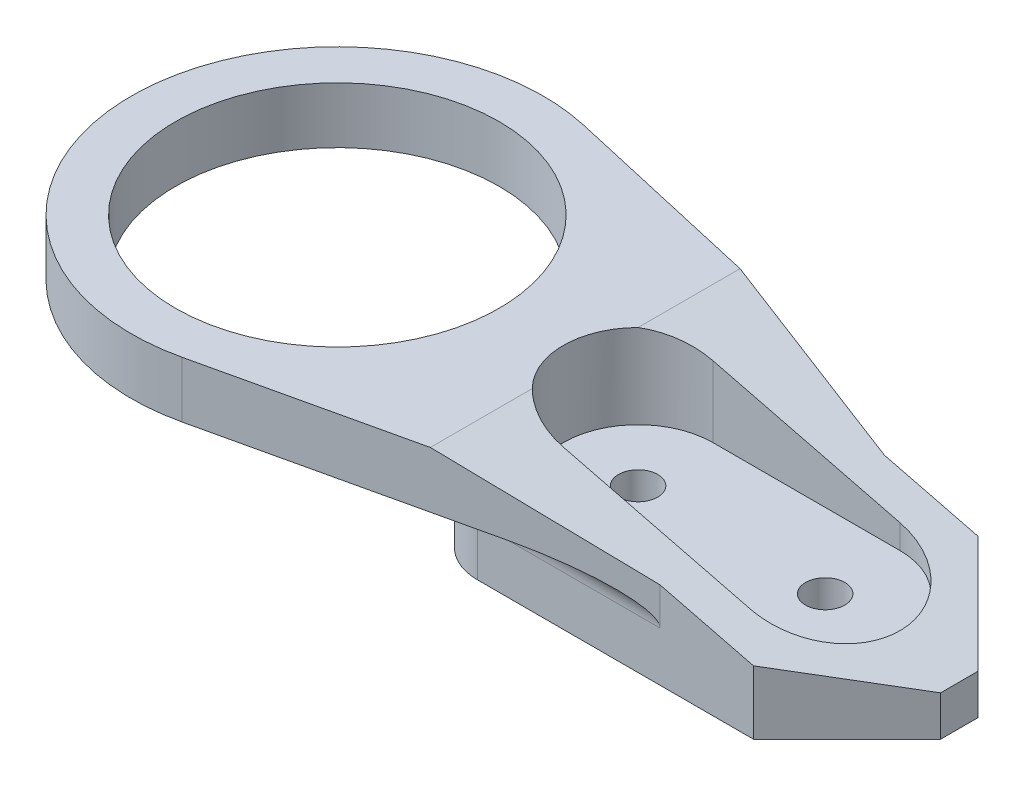
ISO-10303-21;
HEADER;
FILE_DESCRIPTION(('STEP AP214'),'2;1');
FILE_NAME('part.step','',(''),(''),'','','');
FILE_SCHEMA(('AUTOMOTIVE_DESIGN { 1 0 10303 214 1 1 1 1 }'));
ENDSEC;
DATA;
#1=APPLICATION_CONTEXT('core data for automotive mechanical design processes');
#2=APPLICATION_PROTOCOL_DEFINITION('international standard','automotive_design',2000,#1);
#3=PRODUCT_CONTEXT('',#1,'mechanical');
#4=PRODUCT('Part','Part','',(#3));
#5=PRODUCT_RELATED_PRODUCT_CATEGORY('part','',(#4));
#6=PRODUCT_DEFINITION_FORMATION('','',#4);
#7=PRODUCT_DEFINITION_CONTEXT('part definition',#1,'design');
#8=PRODUCT_DEFINITION('design','',#6,#7);
#9=PRODUCT_DEFINITION_SHAPE('','',#8);
#10=(LENGTH_UNIT() NAMED_UNIT(*) SI_UNIT(.MILLI.,.METRE.));
#11=(NAMED_UNIT(*) PLANE_ANGLE_UNIT() SI_UNIT($,.RADIAN.));
#12=(NAMED_UNIT(*) SI_UNIT($,.STERADIAN.) SOLID_ANGLE_UNIT());
#13=UNCERTAINTY_MEASURE_WITH_UNIT(LENGTH_MEASURE(1.E-05),#10,'distance_accuracy_value','');
#14=(GEOMETRIC_REPRESENTATION_CONTEXT(3) GLOBAL_UNCERTAINTY_ASSIGNED_CONTEXT((#13)) GLOBAL_UNIT_ASSIGNED_CONTEXT((#10,
#11,#12)) REPRESENTATION_CONTEXT('',''));
#15=CARTESIAN_POINT('',(0.,0.,0.));
#16=DIRECTION('',(0.,0.,1.));
#17=DIRECTION('',(1.,0.,0.));
#18=AXIS2_PLACEMENT_3D('',#15,#16,#17);
#19=CARTESIAN_POINT('',(17.8298933663439,-2.85,6.));
#20=DIRECTION('',(0.,1.,0.));
#21=DIRECTION('',(0.,0.,1.));
#22=AXIS2_PLACEMENT_3D('',#19,#20,#21);
#23=CYLINDRICAL_SURFACE('',#22,1.05);
#24=CARTESIAN_POINT('',(17.8298933663439,0.,6.));
#25=DIRECTION('',(0.,1.,0.));
#26=DIRECTION('',(-1.,0.,0.));
#27=AXIS2_PLACEMENT_3D('',#24,#25,#26);
#28=CIRCLE('',#27,1.05);
#29=CARTESIAN_POINT('',(16.7798933663439,0.,6.));
#30=VERTEX_POINT('',#29);
#31=EDGE_CURVE('E230',#30,#30,#28,.T.);
#32=ORIENTED_EDGE('',*,*,#31,.F.);
#33=EDGE_LOOP('',(#32));
#34=FACE_BOUND('',#33,.T.);
#35=CARTESIAN_POINT('',(17.8298933663439,2.65,6.));
#36=DIRECTION('',(0.,1.,0.));
#37=DIRECTION('',(0.,0.,1.));
#38=AXIS2_PLACEMENT_3D('',#35,#36,#37);
#39=CIRCLE('',#38,1.05);
#40=CARTESIAN_POINT('',(17.8298933663439,2.65,7.05));
#41=VERTEX_POINT('',#40);
#42=EDGE_CURVE('E227',#41,#41,#39,.F.);
#43=ORIENTED_EDGE('',*,*,#42,.F.);
#44=EDGE_LOOP('',(#43));
#45=FACE_BOUND('',#44,.T.);
#46=ADVANCED_FACE('F42',(#34,#45),#23,.F.);
#47=CARTESIAN_POINT('',(7.82989336634394,-2.85,6.));
#48=DIRECTION('',(0.,1.,0.));
#49=DIRECTION('',(0.,0.,1.));
#50=AXIS2_PLACEMENT_3D('',#47,#48,#49);
#51=CYLINDRICAL_SURFACE('',#50,1.05);
#52=CARTESIAN_POINT('',(7.82989336634394,0.,6.));
#53=DIRECTION('',(0.,1.,0.));
#54=DIRECTION('',(-1.,0.,0.));
#55=AXIS2_PLACEMENT_3D('',#52,#53,#54);
#56=CIRCLE('',#55,1.05);
#57=CARTESIAN_POINT('',(6.77989336634394,0.,6.));
#58=VERTEX_POINT('',#57);
#59=EDGE_CURVE('E233',#58,#58,#56,.T.);
#60=ORIENTED_EDGE('',*,*,#59,.F.);
#61=EDGE_LOOP('',(#60));
#62=FACE_BOUND('',#61,.T.);
#63=CARTESIAN_POINT('',(7.82989336634394,2.65,6.));
#64=DIRECTION('',(0.,1.,0.));
#65=DIRECTION('',(0.,0.,1.));
#66=AXIS2_PLACEMENT_3D('',#63,#64,#65);
#67=CIRCLE('',#66,1.05);
#68=CARTESIAN_POINT('',(7.82989336634394,2.65,7.05));
#69=VERTEX_POINT('',#68);
#70=EDGE_CURVE('E222',#69,#69,#67,.F.);
#71=ORIENTED_EDGE('',*,*,#70,.F.);
#72=EDGE_LOOP('',(#71));
#73=FACE_BOUND('',#72,.T.);
#74=ADVANCED_FACE('F462',(#62,#73),#51,.F.);
#75=CARTESIAN_POINT('',(0.,0.,12.));
#76=DIRECTION('',(0.,0.,-1.));
#77=DIRECTION('',(-1.,0.,0.));
#78=AXIS2_PLACEMENT_3D('',#75,#76,#77);
#79=PLANE('',#78);
#80=DIRECTION('',(0.,1.,0.));
#81=VECTOR('',#80,1.);
#82=CARTESIAN_POINT('',(15.,4.15,12.));
#83=LINE('',#82,#81);
#84=CARTESIAN_POINT('',(15.,2.65,12.));
#85=VERTEX_POINT('',#84);
#86=CARTESIAN_POINT('',(15.,4.64999999999996,12.));
#87=VERTEX_POINT('',#86);
#88=EDGE_CURVE('E262',#85,#87,#83,.T.);
#89=ORIENTED_EDGE('',*,*,#88,.F.);
#90=DIRECTION('',(1.,0.,0.));
#91=VECTOR('',#90,1.);
#92=CARTESIAN_POINT('',(5.25,2.65,12.));
#93=LINE('',#92,#91);
#94=CARTESIAN_POINT('',(5.25,2.65,12.));
#95=VERTEX_POINT('',#94);
#96=EDGE_CURVE('E346',#85,#95,#93,.F.);
#97=ORIENTED_EDGE('',*,*,#96,.T.);
#98=DIRECTION('',(0.,1.,0.));
#99=VECTOR('',#98,1.);
#100=CARTESIAN_POINT('',(5.25,0.,12.));
#101=LINE('',#100,#99);
#102=CARTESIAN_POINT('',(5.25,0.,12.));
#103=VERTEX_POINT('',#102);
#104=EDGE_CURVE('E327',#95,#103,#101,.F.);
#105=ORIENTED_EDGE('',*,*,#104,.T.);
#106=DIRECTION('',(1.,0.,0.));
#107=VECTOR('',#106,1.);
#108=CARTESIAN_POINT('',(25.,0.,12.));
#109=LINE('',#108,#107);
#110=CARTESIAN_POINT('',(20.,0.,12.));
#111=VERTEX_POINT('',#110);
#112=EDGE_CURVE('E270',#103,#111,#109,.T.);
#113=ORIENTED_EDGE('',*,*,#112,.T.);
#114=DIRECTION('',(0.,1.,0.));
#115=VECTOR('',#114,1.);
#116=CARTESIAN_POINT('',(20.,0.,12.));
#117=LINE('',#116,#115);
#118=CARTESIAN_POINT('',(20.,3.39999999999998,12.));
#119=VERTEX_POINT('',#118);
#120=EDGE_CURVE('E292',#111,#119,#117,.T.);
#121=ORIENTED_EDGE('',*,*,#120,.T.);
#122=DIRECTION('',(0.970142500145333,-0.24253562503633,0.));
#123=VECTOR('',#122,1.);
#124=CARTESIAN_POINT('',(4.99999999999971,7.15,12.));
#125=LINE('',#124,#123);
#126=EDGE_CURVE('E288',#119,#87,#125,.F.);
#127=ORIENTED_EDGE('',*,*,#126,.T.);
#128=EDGE_LOOP('',(#89,#97,#105,#113,#121,#127));
#129=FACE_BOUND('',#128,.T.);
#130=ADVANCED_FACE('F443',(#129),#79,.F.);
#131=CARTESIAN_POINT('',(25.,0.,12.));
#132=DIRECTION('',(0.,1.,0.));
#133=DIRECTION('',(-1.,0.,0.));
#134=AXIS2_PLACEMENT_3D('',#131,#132,#133);
#135=PLANE('',#134);
#136=ORIENTED_EDGE('',*,*,#59,.T.);
#137=EDGE_LOOP('',(#136));
#138=FACE_BOUND('',#137,.T.);
#139=ORIENTED_EDGE('',*,*,#31,.T.);
#140=EDGE_LOOP('',(#139));
#141=FACE_BOUND('',#140,.T.);
#142=ORIENTED_EDGE('',*,*,#112,.F.);
#143=CARTESIAN_POINT('',(5.25,0.,9.));
#144=DIRECTION('',(0.,1.,0.));
#145=DIRECTION('',(-1.,0.,0.));
#146=AXIS2_PLACEMENT_3D('',#143,#144,#145);
#147=CIRCLE('',#146,3.);
#148=CARTESIAN_POINT('',(2.25,0.,9.));
#149=VERTEX_POINT('',#148);
#150=EDGE_CURVE('E331',#103,#149,#147,.F.);
#151=ORIENTED_EDGE('',*,*,#150,.T.);
#152=DIRECTION('',(0.,0.,1.));
#153=VECTOR('',#152,1.);
#154=CARTESIAN_POINT('',(2.25,0.,12.));
#155=LINE('',#154,#153);
#156=CARTESIAN_POINT('',(2.25,0.,3.));
#157=VERTEX_POINT('',#156);
#158=EDGE_CURVE('E242',#157,#149,#155,.T.);
#159=ORIENTED_EDGE('',*,*,#158,.F.);
#160=CARTESIAN_POINT('',(5.25,0.,3.));
#161=DIRECTION('',(0.,1.,0.));
#162=DIRECTION('',(-1.,0.,0.));
#163=AXIS2_PLACEMENT_3D('',#160,#161,#162);
#164=CIRCLE('',#163,3.);
#165=CARTESIAN_POINT('',(5.25,0.,0.));
#166=VERTEX_POINT('',#165);
#167=EDGE_CURVE('E329',#157,#166,#164,.F.);
#168=ORIENTED_EDGE('',*,*,#167,.T.);
#169=DIRECTION('',(1.,0.,0.));
#170=VECTOR('',#169,1.);
#171=CARTESIAN_POINT('',(25.,0.,0.));
#172=LINE('',#171,#170);
#173=CARTESIAN_POINT('',(20.,0.,0.));
#174=VERTEX_POINT('',#173);
#175=EDGE_CURVE('E261',#166,#174,#172,.T.);
#176=ORIENTED_EDGE('',*,*,#175,.T.);
#177=DIRECTION('',(0.707106781186549,0.,0.707106781186547));
#178=VECTOR('',#177,1.);
#179=CARTESIAN_POINT('',(25.,0.,5.00000000000001));
#180=LINE('',#179,#178);
#181=CARTESIAN_POINT('',(25.,0.,5.00000000000001));
#182=VERTEX_POINT('',#181);
#183=EDGE_CURVE('E304',#174,#182,#180,.T.);
#184=ORIENTED_EDGE('',*,*,#183,.T.);
#185=DIRECTION('',(0.,0.,-1.));
#186=VECTOR('',#185,1.);
#187=CARTESIAN_POINT('',(25.,0.,12.));
#188=LINE('',#187,#186);
#189=CARTESIAN_POINT('',(25.,0.,6.99999999999997));
#190=VERTEX_POINT('',#189);
#191=EDGE_CURVE('E272',#190,#182,#188,.T.);
#192=ORIENTED_EDGE('',*,*,#191,.F.);
#193=DIRECTION('',(0.707106781186547,0.,-0.707106781186549));
#194=VECTOR('',#193,1.);
#195=CARTESIAN_POINT('',(20.,0.,12.));
#196=LINE('',#195,#194);
#197=EDGE_CURVE('E306',#190,#111,#196,.F.);
#198=ORIENTED_EDGE('',*,*,#197,.T.);
#199=EDGE_LOOP('',(#142,#151,#159,#168,#176,#184,#192,#198));
#200=FACE_BOUND('',#199,.T.);
#201=ADVANCED_FACE('F386',(#138,#141,#200),#135,.F.);
#202=CARTESIAN_POINT('',(0.,0.,0.));
#203=DIRECTION('',(0.,0.,-1.));
#204=DIRECTION('',(-1.,0.,0.));
#205=AXIS2_PLACEMENT_3D('',#202,#203,#204);
#206=PLANE('',#205);
#207=DIRECTION('',(0.,1.,0.));
#208=VECTOR('',#207,1.);
#209=CARTESIAN_POINT('',(5.25,0.,0.));
#210=LINE('',#209,#208);
#211=CARTESIAN_POINT('',(5.25,2.65,0.));
#212=VERTEX_POINT('',#211);
#213=EDGE_CURVE('E333',#166,#212,#210,.T.);
#214=ORIENTED_EDGE('',*,*,#213,.T.);
#215=DIRECTION('',(-1.,0.,0.));
#216=VECTOR('',#215,1.);
#217=CARTESIAN_POINT('',(0.,2.65,0.));
#218=LINE('',#217,#216);
#219=CARTESIAN_POINT('',(15.,2.65,0.));
#220=VERTEX_POINT('',#219);
#221=EDGE_CURVE('E353',#212,#220,#218,.F.);
#222=ORIENTED_EDGE('',*,*,#221,.T.);
#223=DIRECTION('',(0.,1.,0.));
#224=VECTOR('',#223,1.);
#225=CARTESIAN_POINT('',(15.,4.15,0.));
#226=LINE('',#225,#224);
#227=CARTESIAN_POINT('',(15.,4.64999999999996,0.));
#228=VERTEX_POINT('',#227);
#229=EDGE_CURVE('E58',#220,#228,#226,.T.);
#230=ORIENTED_EDGE('',*,*,#229,.T.);
#231=DIRECTION('',(-0.970142500145333,0.24253562503633,0.));
#232=VECTOR('',#231,1.);
#233=CARTESIAN_POINT('',(1.97647058823525,7.9058823529411,0.));
#234=LINE('',#233,#232);
#235=CARTESIAN_POINT('',(20.,3.39999999999998,0.));
#236=VERTEX_POINT('',#235);
#237=EDGE_CURVE('E282',#228,#236,#234,.F.);
#238=ORIENTED_EDGE('',*,*,#237,.T.);
#239=DIRECTION('',(0.,-1.,0.));
#240=VECTOR('',#239,1.);
#241=CARTESIAN_POINT('',(20.,0.,0.));
#242=LINE('',#241,#240);
#243=EDGE_CURVE('E309',#236,#174,#242,.T.);
#244=ORIENTED_EDGE('',*,*,#243,.T.);
#245=ORIENTED_EDGE('',*,*,#175,.F.);
#246=EDGE_LOOP('',(#214,#222,#230,#238,#244,#245));
#247=FACE_BOUND('',#246,.T.);
#248=ADVANCED_FACE('F378',(#247),#206,.T.);
#249=CARTESIAN_POINT('',(25.,7.15,12.));
#250=DIRECTION('',(-1.,0.,0.));
#251=DIRECTION('',(0.,0.,1.));
#252=AXIS2_PLACEMENT_3D('',#249,#250,#251);
#253=PLANE('',#252);
#254=DIRECTION('',(0.,0.,1.));
#255=VECTOR('',#254,1.);
#256=CARTESIAN_POINT('',(25.,2.14999999999999,12.));
#257=LINE('',#256,#255);
#258=CARTESIAN_POINT('',(25.,2.14999999999999,5.00000000000001));
#259=VERTEX_POINT('',#258);
#260=CARTESIAN_POINT('',(25.,2.14999999999999,6.99999999999997));
#261=VERTEX_POINT('',#260);
#262=EDGE_CURVE('E285',#259,#261,#257,.T.);
#263=ORIENTED_EDGE('',*,*,#262,.T.);
#264=DIRECTION('',(0.,-1.,0.));
#265=VECTOR('',#264,1.);
#266=CARTESIAN_POINT('',(25.,7.15,6.99999999999997));
#267=LINE('',#266,#265);
#268=EDGE_CURVE('E302',#261,#190,#267,.T.);
#269=ORIENTED_EDGE('',*,*,#268,.T.);
#270=ORIENTED_EDGE('',*,*,#191,.T.);
#271=DIRECTION('',(0.,1.,0.));
#272=VECTOR('',#271,1.);
#273=CARTESIAN_POINT('',(25.,2.14999999999999,5.00000000000001));
#274=LINE('',#273,#272);
#275=EDGE_CURVE('E299',#182,#259,#274,.T.);
#276=ORIENTED_EDGE('',*,*,#275,.T.);
#277=EDGE_LOOP('',(#263,#269,#270,#276));
#278=FACE_BOUND('',#277,.T.);
#279=ADVANCED_FACE('F437',(#278),#253,.F.);
#280=CARTESIAN_POINT('',(0.,7.15,12.));
#281=DIRECTION('',(0.,-1.,0.));
#282=DIRECTION('',(0.,0.,-1.));
#283=AXIS2_PLACEMENT_3D('',#280,#281,#282);
#284=PLANE('',#283);
#285=CARTESIAN_POINT('',(-8.25,7.15,6.));
#286=DIRECTION('',(0.,-1.,0.));
#287=DIRECTION('',(0.,0.,-1.));
#288=AXIS2_PLACEMENT_3D('',#285,#286,#287);
#289=CIRCLE('',#288,8.65);
#290=CARTESIAN_POINT('',(-8.25,7.15,-2.65));
#291=VERTEX_POINT('',#290);
#292=EDGE_CURVE('E239',#291,#291,#289,.T.);
#293=ORIENTED_EDGE('',*,*,#292,.T.);
#294=EDGE_LOOP('',(#293));
#295=FACE_BOUND('',#294,.T.);
#296=DIRECTION('',(0.,0.,-1.));
#297=VECTOR('',#296,1.);
#298=CARTESIAN_POINT('',(4.99999999999971,7.15,12.));
#299=LINE('',#298,#297);
#300=CARTESIAN_POINT('',(4.99999999999971,7.15,14.2771102196746));
#301=VERTEX_POINT('',#300);
#302=CARTESIAN_POINT('',(4.99999999999971,7.15,8.82696012266195));
#303=VERTEX_POINT('',#302);
#304=EDGE_CURVE('E277',#301,#303,#299,.T.);
#305=ORIENTED_EDGE('',*,*,#304,.T.);
#306=CARTESIAN_POINT('',(7.82989336634394,7.15,6.));
#307=DIRECTION('',(0.,1.,0.));
#308=DIRECTION('',(0.,0.,1.));
#309=AXIS2_PLACEMENT_3D('',#306,#307,#308);
#310=CIRCLE('',#309,4.);
#311=CARTESIAN_POINT('',(4.99999999999971,7.15,3.17303987733804));
#312=VERTEX_POINT('',#311);
#313=EDGE_CURVE('E214',#312,#303,#310,.T.);
#314=ORIENTED_EDGE('',*,*,#313,.F.);
#315=CARTESIAN_POINT('',(4.99999999999971,7.15,-2.27711021967455));
#316=VERTEX_POINT('',#315);
#317=EDGE_CURVE('E276',#312,#316,#299,.T.);
#318=ORIENTED_EDGE('',*,*,#317,.T.);
#319=DIRECTION('',(-0.975040415413256,0.,-0.222027449453318));
#320=VECTOR('',#319,1.);
#321=CARTESIAN_POINT('',(0.739442824661187,7.15,-3.24728604822164));
#322=LINE('',#321,#320);
#323=CARTESIAN_POINT('',(-5.80494920248651,7.15,-4.73751624487906));
#324=VERTEX_POINT('',#323);
#325=EDGE_CURVE('E245',#316,#324,#322,.T.);
#326=ORIENTED_EDGE('',*,*,#325,.T.);
#327=CARTESIAN_POINT('',(-8.25,7.15,6.));
#328=DIRECTION('',(0.,1.,0.));
#329=DIRECTION('',(0.,0.,1.));
#330=AXIS2_PLACEMENT_3D('',#327,#328,#329);
#331=CIRCLE('',#330,11.0123806922692);
#332=CARTESIAN_POINT('',(-5.80494920248651,7.15,16.7375162448791));
#333=VERTEX_POINT('',#332);
#334=EDGE_CURVE('E256',#324,#333,#331,.T.);
#335=ORIENTED_EDGE('',*,*,#334,.T.);
#336=DIRECTION('',(-0.975040415413256,0.,0.222027449453318));
#337=VECTOR('',#336,1.);
#338=CARTESIAN_POINT('',(3.3372716632385,7.15,14.6557317884927));
#339=LINE('',#338,#337);
#340=EDGE_CURVE('E249',#301,#333,#339,.T.);
#341=ORIENTED_EDGE('',*,*,#340,.F.);
#342=EDGE_LOOP('',(#305,#314,#318,#326,#335,#341));
#343=FACE_BOUND('',#342,.T.);
#344=ADVANCED_FACE('F420',(#295,#343),#284,.F.);
#345=CARTESIAN_POINT('',(0.739442824661187,4.15,-3.24728604822164));
#346=DIRECTION('',(0.222027449453318,0.,-0.975040415413256));
#347=DIRECTION('',(-0.975040415413256,0.,-0.222027449453318));
#348=AXIS2_PLACEMENT_3D('',#345,#346,#347);
#349=PLANE('',#348);
#350=ORIENTED_EDGE('',*,*,#325,.F.);
#351=DIRECTION('',(-0.947302626103098,0.236825656525771,-0.215711249102385));
#352=VECTOR('',#351,1.);
#353=CARTESIAN_POINT('',(1.65143880185032,7.98714029953734,-3.0396145122257));
#354=LINE('',#353,#352);
#355=EDGE_CURVE('E280',#316,#228,#354,.F.);
#356=ORIENTED_EDGE('',*,*,#355,.T.);
#357=ORIENTED_EDGE('',*,*,#229,.F.);
#358=CARTESIAN_POINT('',(8.41270357912484,2.65,-1.5));
#359=DIRECTION('',(0.222027449453318,0.,-0.975040415413256));
#360=DIRECTION('',(-0.975040415413256,0.,-0.222027449453318));
#361=AXIS2_PLACEMENT_3D('',#358,#359,#360);
#362=ELLIPSE('',#361,6.75592141284034,1.5);
#363=CARTESIAN_POINT('',(8.41270357912484,4.15,-1.5));
#364=VERTEX_POINT('',#363);
#365=EDGE_CURVE('E11',#220,#364,#362,.F.);
#366=ORIENTED_EDGE('',*,*,#365,.T.);
#367=DIRECTION('',(-0.975040415413256,0.,-0.222027449453318));
#368=VECTOR('',#367,1.);
#369=CARTESIAN_POINT('',(0.739442824661187,4.15,-3.24728604822164));
#370=LINE('',#369,#368);
#371=CARTESIAN_POINT('',(-5.80494920248651,4.15,-4.73751624487906));
#372=VERTEX_POINT('',#371);
#373=EDGE_CURVE('E246',#364,#372,#370,.T.);
#374=ORIENTED_EDGE('',*,*,#373,.T.);
#375=DIRECTION('',(0.,1.,0.));
#376=VECTOR('',#375,1.);
#377=CARTESIAN_POINT('',(-5.80494920248651,4.15,-4.73751624487906));
#378=LINE('',#377,#376);
#379=EDGE_CURVE('E254',#372,#324,#378,.T.);
#380=ORIENTED_EDGE('',*,*,#379,.T.);
#381=EDGE_LOOP('',(#350,#356,#357,#366,#374,#380));
#382=FACE_BOUND('',#381,.T.);
#383=ADVANCED_FACE('F418',(#382),#349,.T.);
#384=CARTESIAN_POINT('',(3.3372716632385,4.15,14.6557317884927));
#385=DIRECTION('',(-0.222027449453318,0.,-0.975040415413256));
#386=DIRECTION('',(-0.975040415413256,0.,0.222027449453318));
#387=AXIS2_PLACEMENT_3D('',#384,#385,#386);
#388=PLANE('',#387);
#389=ORIENTED_EDGE('',*,*,#88,.T.);
#390=DIRECTION('',(0.947302626103098,-0.236825656525771,-0.215711249102385));
#391=VECTOR('',#390,1.);
#392=CARTESIAN_POINT('',(5.46531342989284,7.03367164252672,14.1711532230184));
#393=LINE('',#392,#391);
#394=EDGE_CURVE('E290',#87,#301,#393,.F.);
#395=ORIENTED_EDGE('',*,*,#394,.T.);
#396=ORIENTED_EDGE('',*,*,#340,.T.);
#397=DIRECTION('',(0.,1.,0.));
#398=VECTOR('',#397,1.);
#399=CARTESIAN_POINT('',(-5.80494920248651,4.15,16.7375162448791));
#400=LINE('',#399,#398);
#401=CARTESIAN_POINT('',(-5.80494920248651,4.15,16.7375162448791));
#402=VERTEX_POINT('',#401);
#403=EDGE_CURVE('E265',#402,#333,#400,.T.);
#404=ORIENTED_EDGE('',*,*,#403,.F.);
#405=DIRECTION('',(-0.975040415413256,0.,0.222027449453318));
#406=VECTOR('',#405,1.);
#407=CARTESIAN_POINT('',(3.3372716632385,4.15,14.6557317884927));
#408=LINE('',#407,#406);
#409=CARTESIAN_POINT('',(8.41270357912485,4.15,13.5));
#410=VERTEX_POINT('',#409);
#411=EDGE_CURVE('E252',#410,#402,#408,.T.);
#412=ORIENTED_EDGE('',*,*,#411,.F.);
#413=CARTESIAN_POINT('',(8.41270357912485,2.65,13.5));
#414=DIRECTION('',(-0.222027449453318,0.,-0.975040415413256));
#415=DIRECTION('',(-0.975040415413256,0.,0.222027449453318));
#416=AXIS2_PLACEMENT_3D('',#413,#414,#415);
#417=ELLIPSE('',#416,6.75592141284034,1.5);
#418=EDGE_CURVE('E51',#410,#85,#417,.T.);
#419=ORIENTED_EDGE('',*,*,#418,.T.);
#420=EDGE_LOOP('',(#389,#395,#396,#404,#412,#419));
#421=FACE_BOUND('',#420,.T.);
#422=ADVANCED_FACE('F410',(#421),#388,.F.);
#423=CARTESIAN_POINT('',(-8.25,4.15,6.));
#424=DIRECTION('',(0.,1.,0.));
#425=DIRECTION('',(0.,0.,1.));
#426=AXIS2_PLACEMENT_3D('',#423,#424,#425);
#427=CYLINDRICAL_SURFACE('',#426,11.0123806922692);
#428=ORIENTED_EDGE('',*,*,#334,.F.);
#429=ORIENTED_EDGE('',*,*,#379,.F.);
#430=CARTESIAN_POINT('',(-8.25,4.15,6.));
#431=DIRECTION('',(0.,1.,0.));
#432=DIRECTION('',(0.,0.,1.));
#433=AXIS2_PLACEMENT_3D('',#430,#431,#432);
#434=CIRCLE('',#433,11.0123806922692);
#435=EDGE_CURVE('E248',#372,#402,#434,.T.);
#436=ORIENTED_EDGE('',*,*,#435,.T.);
#437=ORIENTED_EDGE('',*,*,#403,.T.);
#438=EDGE_LOOP('',(#428,#429,#436,#437));
#439=FACE_BOUND('',#438,.T.);
#440=ADVANCED_FACE('F415',(#439),#427,.T.);
#441=CARTESIAN_POINT('',(0.,4.15,0.));
#442=DIRECTION('',(0.,1.,0.));
#443=DIRECTION('',(0.,0.,1.));
#444=AXIS2_PLACEMENT_3D('',#441,#442,#443);
#445=PLANE('',#444);
#446=CARTESIAN_POINT('',(-8.25,4.15,6.));
#447=DIRECTION('',(0.,-1.,0.));
#448=DIRECTION('',(0.,0.,-1.));
#449=AXIS2_PLACEMENT_3D('',#446,#447,#448);
#450=CIRCLE('',#449,8.65);
#451=CARTESIAN_POINT('',(-8.25,4.15,-2.65));
#452=VERTEX_POINT('',#451);
#453=EDGE_CURVE('E236',#452,#452,#450,.T.);
#454=ORIENTED_EDGE('',*,*,#453,.F.);
#455=EDGE_LOOP('',(#454));
#456=FACE_BOUND('',#455,.T.);
#457=CARTESIAN_POINT('',(5.25,4.15,9.));
#458=DIRECTION('',(0.,1.,0.));
#459=DIRECTION('',(0.,0.,1.));
#460=AXIS2_PLACEMENT_3D('',#457,#458,#459);
#461=CIRCLE('',#460,4.5);
#462=CARTESIAN_POINT('',(0.75,4.15,9.));
#463=VERTEX_POINT('',#462);
#464=CARTESIAN_POINT('',(5.25,4.15,13.5));
#465=VERTEX_POINT('',#464);
#466=EDGE_CURVE('E341',#463,#465,#461,.T.);
#467=ORIENTED_EDGE('',*,*,#466,.T.);
#468=DIRECTION('',(1.,0.,0.));
#469=VECTOR('',#468,1.);
#470=CARTESIAN_POINT('',(15.,4.15,13.5));
#471=LINE('',#470,#469);
#472=EDGE_CURVE('E343',#465,#410,#471,.T.);
#473=ORIENTED_EDGE('',*,*,#472,.T.);
#474=ORIENTED_EDGE('',*,*,#411,.T.);
#475=ORIENTED_EDGE('',*,*,#435,.F.);
#476=ORIENTED_EDGE('',*,*,#373,.F.);
#477=DIRECTION('',(-1.,0.,0.));
#478=VECTOR('',#477,1.);
#479=CARTESIAN_POINT('',(0.,4.15,-1.5));
#480=LINE('',#479,#478);
#481=CARTESIAN_POINT('',(5.25,4.15,-1.5));
#482=VERTEX_POINT('',#481);
#483=EDGE_CURVE('E335',#364,#482,#480,.T.);
#484=ORIENTED_EDGE('',*,*,#483,.T.);
#485=CARTESIAN_POINT('',(5.25,4.15,3.));
#486=DIRECTION('',(0.,1.,0.));
#487=DIRECTION('',(0.,0.,1.));
#488=AXIS2_PLACEMENT_3D('',#485,#486,#487);
#489=CIRCLE('',#488,4.5);
#490=CARTESIAN_POINT('',(0.75,4.15,3.));
#491=VERTEX_POINT('',#490);
#492=EDGE_CURVE('E337',#482,#491,#489,.T.);
#493=ORIENTED_EDGE('',*,*,#492,.T.);
#494=DIRECTION('',(0.,0.,1.));
#495=VECTOR('',#494,1.);
#496=CARTESIAN_POINT('',(0.75,4.15,0.));
#497=LINE('',#496,#495);
#498=EDGE_CURVE('E339',#491,#463,#497,.T.);
#499=ORIENTED_EDGE('',*,*,#498,.T.);
#500=EDGE_LOOP('',(#467,#473,#474,#475,#476,#484,#493,#499));
#501=FACE_BOUND('',#500,.T.);
#502=ADVANCED_FACE('F406',(#456,#501),#445,.F.);
#503=CARTESIAN_POINT('',(2.25,-16.85,6.));
#504=DIRECTION('',(-1.,0.,0.));
#505=DIRECTION('',(0.,0.,1.));
#506=AXIS2_PLACEMENT_3D('',#503,#504,#505);
#507=PLANE('',#506);
#508=DIRECTION('',(0.,1.,0.));
#509=VECTOR('',#508,1.);
#510=CARTESIAN_POINT('',(2.25,4.15,9.));
#511=LINE('',#510,#509);
#512=CARTESIAN_POINT('',(2.25,2.65,9.));
#513=VERTEX_POINT('',#512);
#514=EDGE_CURVE('E324',#149,#513,#511,.T.);
#515=ORIENTED_EDGE('',*,*,#514,.T.);
#516=DIRECTION('',(0.,0.,1.));
#517=VECTOR('',#516,1.);
#518=CARTESIAN_POINT('',(2.25,2.65,6.));
#519=LINE('',#518,#517);
#520=CARTESIAN_POINT('',(2.25,2.65,3.));
#521=VERTEX_POINT('',#520);
#522=EDGE_CURVE('E350',#513,#521,#519,.F.);
#523=ORIENTED_EDGE('',*,*,#522,.T.);
#524=DIRECTION('',(0.,1.,0.));
#525=VECTOR('',#524,1.);
#526=CARTESIAN_POINT('',(2.25,-16.85,3.));
#527=LINE('',#526,#525);
#528=EDGE_CURVE('E322',#521,#157,#527,.F.);
#529=ORIENTED_EDGE('',*,*,#528,.T.);
#530=ORIENTED_EDGE('',*,*,#158,.T.);
#531=EDGE_LOOP('',(#515,#523,#529,#530));
#532=FACE_BOUND('',#531,.T.);
#533=ADVANCED_FACE('F390',(#532),#507,.T.);
#534=CARTESIAN_POINT('',(-8.25,14.15,6.));
#535=DIRECTION('',(0.,-1.,0.));
#536=DIRECTION('',(0.,0.,-1.));
#537=AXIS2_PLACEMENT_3D('',#534,#535,#536);
#538=CYLINDRICAL_SURFACE('',#537,8.65);
#539=ORIENTED_EDGE('',*,*,#453,.T.);
#540=EDGE_LOOP('',(#539));
#541=FACE_BOUND('',#540,.T.);
#542=ORIENTED_EDGE('',*,*,#292,.F.);
#543=EDGE_LOOP('',(#542));
#544=FACE_BOUND('',#543,.T.);
#545=ADVANCED_FACE('F473',(#541,#544),#538,.F.);
#546=CARTESIAN_POINT('',(4.99999999999971,7.15,12.));
#547=DIRECTION('',(-0.24253562503633,-0.970142500145333,0.));
#548=DIRECTION('',(0.,0.,-1.));
#549=AXIS2_PLACEMENT_3D('',#546,#547,#548);
#550=PLANE('',#549);
#551=CARTESIAN_POINT('',(7.82989336634394,6.44252665841395,6.));
#552=DIRECTION('',(-0.24253562503633,-0.970142500145333,0.));
#553=DIRECTION('',(-0.970142500145333,0.24253562503633,0.));
#554=AXIS2_PLACEMENT_3D('',#551,#552,#553);
#555=ELLIPSE('',#554,4.12310562561766,4.);
#556=CARTESIAN_POINT('',(7.82989336634394,6.44252665841395,10.));
#557=VERTEX_POINT('',#556);
#558=EDGE_CURVE('E196',#303,#557,#555,.F.);
#559=ORIENTED_EDGE('',*,*,#558,.F.);
#560=ORIENTED_EDGE('',*,*,#304,.F.);
#561=ORIENTED_EDGE('',*,*,#394,.F.);
#562=ORIENTED_EDGE('',*,*,#126,.F.);
#563=DIRECTION('',(0.696310623822791,-0.174077655955695,-0.696310623822793));
#564=VECTOR('',#563,1.);
#565=CARTESIAN_POINT('',(12.2727272727271,5.33181818181817,19.7272727272729));
#566=LINE('',#565,#564);
#567=EDGE_CURVE('E297',#119,#261,#566,.T.);
#568=ORIENTED_EDGE('',*,*,#567,.T.);
#569=ORIENTED_EDGE('',*,*,#262,.F.);
#570=DIRECTION('',(0.696310623822793,-0.174077655955696,0.696310623822791));
#571=VECTOR('',#570,1.);
#572=CARTESIAN_POINT('',(18.0909090909089,3.87727272727274,-1.90909090909105));
#573=LINE('',#572,#571);
#574=EDGE_CURVE('E295',#259,#236,#573,.F.);
#575=ORIENTED_EDGE('',*,*,#574,.T.);
#576=ORIENTED_EDGE('',*,*,#237,.F.);
#577=ORIENTED_EDGE('',*,*,#355,.F.);
#578=ORIENTED_EDGE('',*,*,#317,.F.);
#579=CARTESIAN_POINT('',(7.82989336634394,6.44252665841395,2.));
#580=VERTEX_POINT('',#579);
#581=EDGE_CURVE('E320',#580,#312,#555,.F.);
#582=ORIENTED_EDGE('',*,*,#581,.F.);
#583=DIRECTION('',(0.970142500145333,-0.24253562503633,0.));
#584=VECTOR('',#583,1.);
#585=CARTESIAN_POINT('',(4.99999999999971,7.15,2.));
#586=LINE('',#585,#584);
#587=CARTESIAN_POINT('',(17.8298933663439,3.94252665841398,2.));
#588=VERTEX_POINT('',#587);
#589=EDGE_CURVE('E318',#588,#580,#586,.F.);
#590=ORIENTED_EDGE('',*,*,#589,.F.);
#591=CARTESIAN_POINT('',(17.8298933663439,3.94252665841398,6.));
#592=DIRECTION('',(-0.24253562503633,-0.970142500145333,0.));
#593=DIRECTION('',(-0.970142500145333,0.24253562503633,0.));
#594=AXIS2_PLACEMENT_3D('',#591,#592,#593);
#595=ELLIPSE('',#594,4.12310562561766,4.);
#596=CARTESIAN_POINT('',(17.8298933663439,3.94252665841398,10.));
#597=VERTEX_POINT('',#596);
#598=EDGE_CURVE('E316',#597,#588,#595,.F.);
#599=ORIENTED_EDGE('',*,*,#598,.F.);
#600=DIRECTION('',(-0.970142500145333,0.24253562503633,0.));
#601=VECTOR('',#600,1.);
#602=CARTESIAN_POINT('',(4.99999999999971,7.15,10.));
#603=LINE('',#602,#601);
#604=EDGE_CURVE('E312',#557,#597,#603,.F.);
#605=ORIENTED_EDGE('',*,*,#604,.F.);
#606=EDGE_LOOP('',(#559,#560,#561,#562,#568,#569,#575,#576,#577,#578,#582,#590,#599,#605));
#607=FACE_BOUND('',#606,.T.);
#608=ADVANCED_FACE('F427',(#607),#550,.F.);
#609=CARTESIAN_POINT('',(20.,0.,12.));
#610=DIRECTION('',(-0.707106781186549,0.,-0.707106781186547));
#611=DIRECTION('',(0.,1.,0.));
#612=AXIS2_PLACEMENT_3D('',#609,#610,#611);
#613=PLANE('',#612);
#614=ORIENTED_EDGE('',*,*,#197,.F.);
#615=ORIENTED_EDGE('',*,*,#268,.F.);
#616=ORIENTED_EDGE('',*,*,#567,.F.);
#617=ORIENTED_EDGE('',*,*,#120,.F.);
#618=EDGE_LOOP('',(#614,#615,#616,#617));
#619=FACE_BOUND('',#618,.T.);
#620=ADVANCED_FACE('F440',(#619),#613,.F.);
#621=CARTESIAN_POINT('',(25.,7.15,5.00000000000001));
#622=DIRECTION('',(0.707106781186547,0.,-0.707106781186549));
#623=DIRECTION('',(0.,-1.,0.));
#624=AXIS2_PLACEMENT_3D('',#621,#622,#623);
#625=PLANE('',#624);
#626=ORIENTED_EDGE('',*,*,#183,.F.);
#627=ORIENTED_EDGE('',*,*,#243,.F.);
#628=ORIENTED_EDGE('',*,*,#574,.F.);
#629=ORIENTED_EDGE('',*,*,#275,.F.);
#630=EDGE_LOOP('',(#626,#627,#628,#629));
#631=FACE_BOUND('',#630,.T.);
#632=ADVANCED_FACE('F432',(#631),#625,.T.);
#633=CARTESIAN_POINT('',(7.82989336634394,2.65,6.));
#634=DIRECTION('',(0.,1.,0.));
#635=DIRECTION('',(0.,0.,1.));
#636=AXIS2_PLACEMENT_3D('',#633,#634,#635);
#637=PLANE('',#636);
#638=CARTESIAN_POINT('',(7.82989336634394,2.65,6.));
#639=DIRECTION('',(0.,1.,0.));
#640=DIRECTION('',(0.,0.,1.));
#641=AXIS2_PLACEMENT_3D('',#638,#639,#640);
#642=CIRCLE('',#641,4.);
#643=CARTESIAN_POINT('',(7.82989336634394,2.65,2.));
#644=VERTEX_POINT('',#643);
#645=CARTESIAN_POINT('',(7.82989336634394,2.65,10.));
#646=VERTEX_POINT('',#645);
#647=EDGE_CURVE('E193',#644,#646,#642,.T.);
#648=ORIENTED_EDGE('',*,*,#647,.T.);
#649=DIRECTION('',(1.,0.,0.));
#650=VECTOR('',#649,1.);
#651=CARTESIAN_POINT('',(17.8298933663439,2.65,10.));
#652=LINE('',#651,#650);
#653=CARTESIAN_POINT('',(17.8298933663439,2.65,10.));
#654=VERTEX_POINT('',#653);
#655=EDGE_CURVE('E203',#646,#654,#652,.T.);
#656=ORIENTED_EDGE('',*,*,#655,.T.);
#657=CARTESIAN_POINT('',(17.8298933663439,2.65,6.));
#658=DIRECTION('',(0.,1.,0.));
#659=DIRECTION('',(0.,0.,1.));
#660=AXIS2_PLACEMENT_3D('',#657,#658,#659);
#661=CIRCLE('',#660,4.);
#662=CARTESIAN_POINT('',(17.8298933663439,2.65,2.));
#663=VERTEX_POINT('',#662);
#664=EDGE_CURVE('E209',#654,#663,#661,.T.);
#665=ORIENTED_EDGE('',*,*,#664,.T.);
#666=DIRECTION('',(-1.,0.,0.));
#667=VECTOR('',#666,1.);
#668=CARTESIAN_POINT('',(7.82989336634394,2.65,2.));
#669=LINE('',#668,#667);
#670=EDGE_CURVE('E200',#663,#644,#669,.T.);
#671=ORIENTED_EDGE('',*,*,#670,.T.);
#672=EDGE_LOOP('',(#648,#656,#665,#671));
#673=FACE_BOUND('',#672,.T.);
#674=ORIENTED_EDGE('',*,*,#70,.T.);
#675=EDGE_LOOP('',(#674));
#676=FACE_BOUND('',#675,.T.);
#677=ORIENTED_EDGE('',*,*,#42,.T.);
#678=EDGE_LOOP('',(#677));
#679=FACE_BOUND('',#678,.T.);
#680=ADVANCED_FACE('F211',(#673,#676,#679),#637,.T.);
#681=CARTESIAN_POINT('',(7.82989336634394,2.65,6.));
#682=DIRECTION('',(0.,1.,0.));
#683=DIRECTION('',(0.,0.,1.));
#684=AXIS2_PLACEMENT_3D('',#681,#682,#683);
#685=CYLINDRICAL_SURFACE('',#684,4.);
#686=ORIENTED_EDGE('',*,*,#558,.T.);
#687=DIRECTION('',(0.,1.,0.));
#688=VECTOR('',#687,1.);
#689=CARTESIAN_POINT('',(7.82989336634394,2.65,10.));
#690=LINE('',#689,#688);
#691=EDGE_CURVE('E188',#646,#557,#690,.T.);
#692=ORIENTED_EDGE('',*,*,#691,.F.);
#693=ORIENTED_EDGE('',*,*,#647,.F.);
#694=DIRECTION('',(0.,1.,0.));
#695=VECTOR('',#694,1.);
#696=CARTESIAN_POINT('',(7.82989336634394,2.65,2.));
#697=LINE('',#696,#695);
#698=EDGE_CURVE('E220',#644,#580,#697,.T.);
#699=ORIENTED_EDGE('',*,*,#698,.T.);
#700=ORIENTED_EDGE('',*,*,#581,.T.);
#701=ORIENTED_EDGE('',*,*,#313,.T.);
#702=EDGE_LOOP('',(#686,#692,#693,#699,#700,#701));
#703=FACE_BOUND('',#702,.T.);
#704=ADVANCED_FACE('F190',(#703),#685,.F.);
#705=CARTESIAN_POINT('',(7.82989336634394,2.65,2.));
#706=DIRECTION('',(0.,0.,-1.));
#707=DIRECTION('',(-1.,0.,0.));
#708=AXIS2_PLACEMENT_3D('',#705,#706,#707);
#709=PLANE('',#708);
#710=ORIENTED_EDGE('',*,*,#589,.T.);
#711=ORIENTED_EDGE('',*,*,#698,.F.);
#712=ORIENTED_EDGE('',*,*,#670,.F.);
#713=DIRECTION('',(0.,1.,0.));
#714=VECTOR('',#713,1.);
#715=CARTESIAN_POINT('',(17.8298933663439,2.65,2.));
#716=LINE('',#715,#714);
#717=EDGE_CURVE('E223',#663,#588,#716,.T.);
#718=ORIENTED_EDGE('',*,*,#717,.T.);
#719=EDGE_LOOP('',(#710,#711,#712,#718));
#720=FACE_BOUND('',#719,.T.);
#721=ADVANCED_FACE('F451',(#720),#709,.F.);
#722=CARTESIAN_POINT('',(17.8298933663439,2.65,6.));
#723=DIRECTION('',(0.,1.,0.));
#724=DIRECTION('',(0.,0.,1.));
#725=AXIS2_PLACEMENT_3D('',#722,#723,#724);
#726=CYLINDRICAL_SURFACE('',#725,4.);
#727=ORIENTED_EDGE('',*,*,#598,.T.);
#728=ORIENTED_EDGE('',*,*,#717,.F.);
#729=ORIENTED_EDGE('',*,*,#664,.F.);
#730=DIRECTION('',(0.,1.,0.));
#731=VECTOR('',#730,1.);
#732=CARTESIAN_POINT('',(17.8298933663439,2.65,10.));
#733=LINE('',#732,#731);
#734=EDGE_CURVE('E199',#654,#597,#733,.T.);
#735=ORIENTED_EDGE('',*,*,#734,.T.);
#736=EDGE_LOOP('',(#727,#728,#729,#735));
#737=FACE_BOUND('',#736,.T.);
#738=ADVANCED_FACE('F449',(#737),#726,.F.);
#739=CARTESIAN_POINT('',(17.8298933663439,2.65,10.));
#740=DIRECTION('',(0.,0.,1.));
#741=DIRECTION('',(1.,0.,0.));
#742=AXIS2_PLACEMENT_3D('',#739,#740,#741);
#743=PLANE('',#742);
#744=ORIENTED_EDGE('',*,*,#604,.T.);
#745=ORIENTED_EDGE('',*,*,#734,.F.);
#746=ORIENTED_EDGE('',*,*,#655,.F.);
#747=ORIENTED_EDGE('',*,*,#691,.T.);
#748=EDGE_LOOP('',(#744,#745,#746,#747));
#749=FACE_BOUND('',#748,.T.);
#750=ADVANCED_FACE('F204',(#749),#743,.F.);
#751=CARTESIAN_POINT('',(5.25,-16.85,9.));
#752=DIRECTION('',(0.,-1.,0.));
#753=DIRECTION('',(0.,0.,-1.));
#754=AXIS2_PLACEMENT_3D('',#751,#752,#753);
#755=CYLINDRICAL_SURFACE('',#754,3.);
#756=ORIENTED_EDGE('',*,*,#104,.F.);
#757=CARTESIAN_POINT('',(5.25,2.65,9.));
#758=DIRECTION('',(0.,1.,0.));
#759=DIRECTION('',(0.,0.,1.));
#760=AXIS2_PLACEMENT_3D('',#757,#758,#759);
#761=CIRCLE('',#760,3.);
#762=EDGE_CURVE('E348',#95,#513,#761,.F.);
#763=ORIENTED_EDGE('',*,*,#762,.T.);
#764=ORIENTED_EDGE('',*,*,#514,.F.);
#765=ORIENTED_EDGE('',*,*,#150,.F.);
#766=EDGE_LOOP('',(#756,#763,#764,#765));
#767=FACE_BOUND('',#766,.T.);
#768=ADVANCED_FACE('F393',(#767),#755,.T.);
#769=CARTESIAN_POINT('',(5.25,0.,3.));
#770=DIRECTION('',(0.,1.,0.));
#771=DIRECTION('',(0.,0.,1.));
#772=AXIS2_PLACEMENT_3D('',#769,#770,#771);
#773=CYLINDRICAL_SURFACE('',#772,3.);
#774=ORIENTED_EDGE('',*,*,#528,.F.);
#775=CARTESIAN_POINT('',(5.25,2.65,3.));
#776=DIRECTION('',(0.,1.,0.));
#777=DIRECTION('',(0.,0.,1.));
#778=AXIS2_PLACEMENT_3D('',#775,#776,#777);
#779=CIRCLE('',#778,3.);
#780=EDGE_CURVE('E66',#521,#212,#779,.F.);
#781=ORIENTED_EDGE('',*,*,#780,.T.);
#782=ORIENTED_EDGE('',*,*,#213,.F.);
#783=ORIENTED_EDGE('',*,*,#167,.F.);
#784=EDGE_LOOP('',(#774,#781,#782,#783));
#785=FACE_BOUND('',#784,.T.);
#786=ADVANCED_FACE('F382',(#785),#773,.T.);
#787=CARTESIAN_POINT('',(0.,2.65,-1.5));
#788=DIRECTION('',(-1.,0.,0.));
#789=DIRECTION('',(0.,0.,1.));
#790=AXIS2_PLACEMENT_3D('',#787,#788,#789);
#791=CYLINDRICAL_SURFACE('',#790,1.5);
#792=ORIENTED_EDGE('',*,*,#365,.F.);
#793=ORIENTED_EDGE('',*,*,#221,.F.);
#794=CARTESIAN_POINT('',(5.25,2.65,-1.5));
#795=DIRECTION('',(1.,0.,0.));
#796=DIRECTION('',(0.,0.,-1.));
#797=AXIS2_PLACEMENT_3D('',#794,#795,#796);
#798=CIRCLE('',#797,1.5);
#799=EDGE_CURVE('E46',#482,#212,#798,.T.);
#800=ORIENTED_EDGE('',*,*,#799,.F.);
#801=ORIENTED_EDGE('',*,*,#483,.F.);
#802=EDGE_LOOP('',(#792,#793,#800,#801));
#803=FACE_BOUND('',#802,.T.);
#804=ADVANCED_FACE('F44',(#803),#791,.F.);
#805=CARTESIAN_POINT('',(5.25,2.65,3.));
#806=DIRECTION('',(0.,1.,0.));
#807=DIRECTION('',(0.,0.,1.));
#808=AXIS2_PLACEMENT_3D('',#805,#806,#807);
#809=TOROIDAL_SURFACE('',#808,4.5,1.5);
#810=ORIENTED_EDGE('',*,*,#799,.T.);
#811=ORIENTED_EDGE('',*,*,#780,.F.);
#812=CARTESIAN_POINT('',(0.75,2.65,3.));
#813=DIRECTION('',(0.,0.,-1.));
#814=DIRECTION('',(-1.,0.,0.));
#815=AXIS2_PLACEMENT_3D('',#812,#813,#814);
#816=CIRCLE('',#815,1.5);
#817=EDGE_CURVE('E362',#491,#521,#816,.T.);
#818=ORIENTED_EDGE('',*,*,#817,.F.);
#819=ORIENTED_EDGE('',*,*,#492,.F.);
#820=EDGE_LOOP('',(#810,#811,#818,#819));
#821=FACE_BOUND('',#820,.T.);
#822=ADVANCED_FACE('F372',(#821),#809,.F.);
#823=CARTESIAN_POINT('',(0.75,2.65,0.));
#824=DIRECTION('',(0.,0.,1.));
#825=DIRECTION('',(1.,0.,0.));
#826=AXIS2_PLACEMENT_3D('',#823,#824,#825);
#827=CYLINDRICAL_SURFACE('',#826,1.5);
#828=ORIENTED_EDGE('',*,*,#817,.T.);
#829=ORIENTED_EDGE('',*,*,#522,.F.);
#830=CARTESIAN_POINT('',(0.75,2.65,9.));
#831=DIRECTION('',(0.,0.,-1.));
#832=DIRECTION('',(-1.,0.,0.));
#833=AXIS2_PLACEMENT_3D('',#830,#831,#832);
#834=CIRCLE('',#833,1.5);
#835=EDGE_CURVE('E360',#463,#513,#834,.T.);
#836=ORIENTED_EDGE('',*,*,#835,.F.);
#837=ORIENTED_EDGE('',*,*,#498,.F.);
#838=EDGE_LOOP('',(#828,#829,#836,#837));
#839=FACE_BOUND('',#838,.T.);
#840=ADVANCED_FACE('F523',(#839),#827,.F.);
#841=CARTESIAN_POINT('',(5.25,2.65,9.));
#842=DIRECTION('',(0.,1.,0.));
#843=DIRECTION('',(0.,0.,1.));
#844=AXIS2_PLACEMENT_3D('',#841,#842,#843);
#845=TOROIDAL_SURFACE('',#844,4.5,1.5);
#846=ORIENTED_EDGE('',*,*,#835,.T.);
#847=ORIENTED_EDGE('',*,*,#762,.F.);
#848=CARTESIAN_POINT('',(5.25,2.65,13.5));
#849=DIRECTION('',(-1.,0.,0.));
#850=DIRECTION('',(0.,0.,1.));
#851=AXIS2_PLACEMENT_3D('',#848,#849,#850);
#852=CIRCLE('',#851,1.5);
#853=EDGE_CURVE('E357',#465,#95,#852,.T.);
#854=ORIENTED_EDGE('',*,*,#853,.F.);
#855=ORIENTED_EDGE('',*,*,#466,.F.);
#856=EDGE_LOOP('',(#846,#847,#854,#855));
#857=FACE_BOUND('',#856,.T.);
#858=ADVANCED_FACE('F397',(#857),#845,.F.);
#859=CARTESIAN_POINT('',(0.,2.65,13.5));
#860=DIRECTION('',(-1.,0.,0.));
#861=DIRECTION('',(0.,0.,1.));
#862=AXIS2_PLACEMENT_3D('',#859,#860,#861);
#863=CYLINDRICAL_SURFACE('',#862,1.5);
#864=ORIENTED_EDGE('',*,*,#853,.T.);
#865=ORIENTED_EDGE('',*,*,#96,.F.);
#866=ORIENTED_EDGE('',*,*,#418,.F.);
#867=ORIENTED_EDGE('',*,*,#472,.F.);
#868=EDGE_LOOP('',(#864,#865,#866,#867));
#869=FACE_BOUND('',#868,.T.);
#870=ADVANCED_FACE('F403',(#869),#863,.F.);
#871=CLOSED_SHELL('',(#46,#74,#130,#201,#248,#279,#344,#383,#422,#440,#502,#533,#545,#608,#620,
#632,#680,#704,#721,#738,#750,#768,#786,#804,#822,#840,#858,#870));
#872=MANIFOLD_SOLID_BREP('B2',#871);
#873=ADVANCED_BREP_SHAPE_REPRESENTATION('',(#18,#872),#14);
#874=SHAPE_DEFINITION_REPRESENTATION(#9,#873);
ENDSEC;
END-ISO-10303-21;
